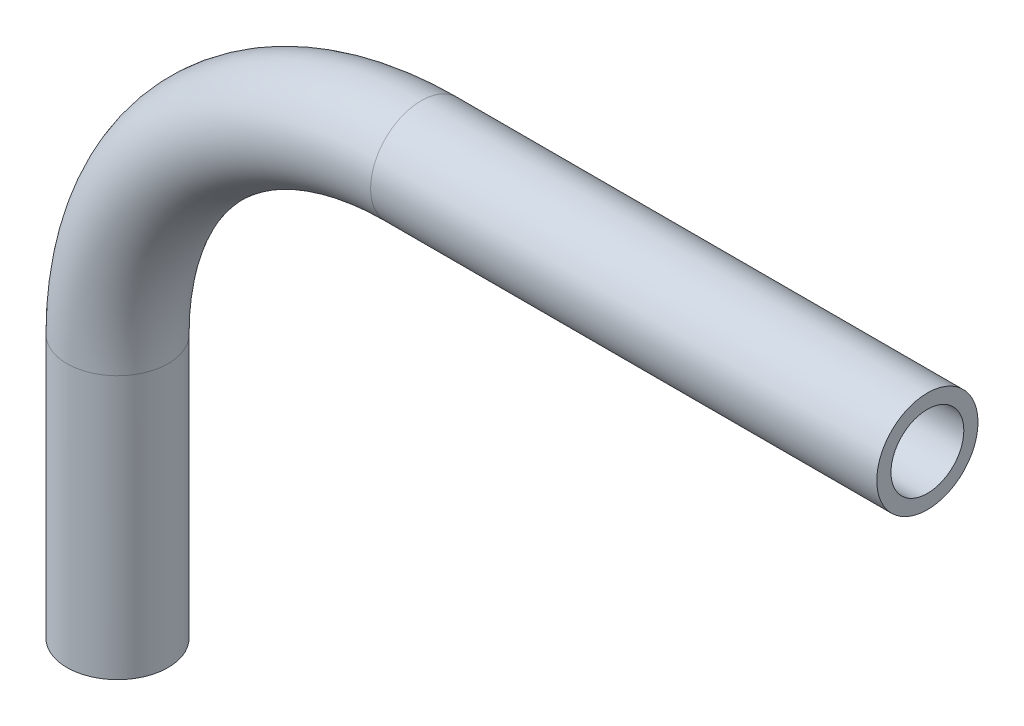
ISO-10303-21;
HEADER;
FILE_DESCRIPTION(('STEP AP214'),'2;1');
FILE_NAME('part.step','',(''),(''),'','','');
FILE_SCHEMA(('AUTOMOTIVE_DESIGN { 1 0 10303 214 1 1 1 1 }'));
ENDSEC;
DATA;
#1=APPLICATION_CONTEXT('core data for automotive mechanical design processes');
#2=APPLICATION_PROTOCOL_DEFINITION('international standard','automotive_design',2000,#1);
#3=PRODUCT_CONTEXT('',#1,'mechanical');
#4=PRODUCT('Part','Part','',(#3));
#5=PRODUCT_RELATED_PRODUCT_CATEGORY('part','',(#4));
#6=PRODUCT_DEFINITION_FORMATION('','',#4);
#7=PRODUCT_DEFINITION_CONTEXT('part definition',#1,'design');
#8=PRODUCT_DEFINITION('design','',#6,#7);
#9=PRODUCT_DEFINITION_SHAPE('','',#8);
#10=(LENGTH_UNIT() NAMED_UNIT(*) SI_UNIT(.MILLI.,.METRE.));
#11=(NAMED_UNIT(*) PLANE_ANGLE_UNIT() SI_UNIT($,.RADIAN.));
#12=(NAMED_UNIT(*) SI_UNIT($,.STERADIAN.) SOLID_ANGLE_UNIT());
#13=UNCERTAINTY_MEASURE_WITH_UNIT(LENGTH_MEASURE(1.E-05),#10,'distance_accuracy_value','');
#14=(GEOMETRIC_REPRESENTATION_CONTEXT(3) GLOBAL_UNCERTAINTY_ASSIGNED_CONTEXT((#13)) GLOBAL_UNIT_ASSIGNED_CONTEXT((#10,
#11,#12)) REPRESENTATION_CONTEXT('',''));
#15=CARTESIAN_POINT('',(0.,0.,0.));
#16=DIRECTION('',(0.,0.,1.));
#17=DIRECTION('',(1.,0.,0.));
#18=AXIS2_PLACEMENT_3D('',#15,#16,#17);
#19=CARTESIAN_POINT('',(0.,-18.0323178807947,0.));
#20=DIRECTION('',(0.,1.,0.));
#21=DIRECTION('',(0.,0.,1.));
#22=AXIS2_PLACEMENT_3D('',#19,#20,#21);
#23=CYLINDRICAL_SURFACE('',#22,3.175);
#24=CARTESIAN_POINT('',(0.,-1.52231788079484,0.));
#25=DIRECTION('',(0.,1.,0.));
#26=DIRECTION('',(0.,0.,-1.));
#27=AXIS2_PLACEMENT_3D('',#24,#25,#26);
#28=CIRCLE('',#27,3.175);
#29=CARTESIAN_POINT('',(-3.175,-1.52231788079487,0.));
#30=VERTEX_POINT('',#29);
#31=EDGE_CURVE('E90',#30,#30,#28,.T.);
#32=ORIENTED_EDGE('',*,*,#31,.F.);
#33=EDGE_LOOP('',(#32));
#34=FACE_BOUND('',#33,.T.);
#35=CARTESIAN_POINT('',(0.,-18.0323178807947,0.));
#36=DIRECTION('',(0.,1.,0.));
#37=DIRECTION('',(0.,0.,-1.));
#38=AXIS2_PLACEMENT_3D('',#35,#36,#37);
#39=CIRCLE('',#38,3.175);
#40=CARTESIAN_POINT('',(0.,-18.0323178807947,-3.175));
#41=VERTEX_POINT('',#40);
#42=EDGE_CURVE('E55',#41,#41,#39,.T.);
#43=ORIENTED_EDGE('',*,*,#42,.T.);
#44=EDGE_LOOP('',(#43));
#45=FACE_BOUND('',#44,.T.);
#46=ADVANCED_FACE('F39',(#34,#45),#23,.T.);
#47=CARTESIAN_POINT('',(19.05,-1.52231788079469,0.));
#48=DIRECTION('',(0.,0.,-1.));
#49=DIRECTION('',(-1.,0.,0.));
#50=AXIS2_PLACEMENT_3D('',#47,#48,#49);
#51=TOROIDAL_SURFACE('',#50,19.05,3.175);
#52=CARTESIAN_POINT('',(19.05,17.5276821192057,0.));
#53=DIRECTION('',(1.,0.,0.));
#54=DIRECTION('',(0.,0.,-1.));
#55=AXIS2_PLACEMENT_3D('',#52,#53,#54);
#56=CIRCLE('',#55,3.175);
#57=CARTESIAN_POINT('',(19.05,20.7026821192053,0.));
#58=VERTEX_POINT('',#57);
#59=EDGE_CURVE('E43',#58,#58,#56,.T.);
#60=CARTESIAN_POINT('',(19.05,-1.52231788079469,0.));
#61=DIRECTION('',(0.,0.,-1.));
#62=DIRECTION('',(-1.,0.,0.));
#63=AXIS2_PLACEMENT_3D('',#60,#61,#62);
#64=CIRCLE('',#63,22.225);
#65=EDGE_CURVE('',#30,#58,#64,.T.);
#66=ORIENTED_EDGE('',*,*,#31,.T.);
#67=ORIENTED_EDGE('',*,*,#59,.F.);
#68=ORIENTED_EDGE('',*,*,#65,.T.);
#69=ORIENTED_EDGE('',*,*,#65,.F.);
#70=EDGE_LOOP('',(#66,#68,#67,#69));
#71=FACE_BOUND('',#70,.T.);
#72=ADVANCED_FACE('F100',(#71),#51,.T.);
#73=CARTESIAN_POINT('',(19.0500000000001,17.5276821192053,0.));
#74=DIRECTION('',(1.,0.,0.));
#75=DIRECTION('',(0.,1.,0.));
#76=AXIS2_PLACEMENT_3D('',#73,#74,#75);
#77=CYLINDRICAL_SURFACE('',#76,3.175);
#78=CARTESIAN_POINT('',(50.8,17.5276821192053,0.));
#79=DIRECTION('',(1.,0.,0.));
#80=DIRECTION('',(0.,0.,-1.));
#81=AXIS2_PLACEMENT_3D('',#78,#79,#80);
#82=CIRCLE('',#81,3.175);
#83=CARTESIAN_POINT('',(50.8,17.5276821192053,-3.175));
#84=VERTEX_POINT('',#83);
#85=EDGE_CURVE('E60',#84,#84,#82,.T.);
#86=ORIENTED_EDGE('',*,*,#85,.F.);
#87=EDGE_LOOP('',(#86));
#88=FACE_BOUND('',#87,.T.);
#89=ORIENTED_EDGE('',*,*,#59,.T.);
#90=EDGE_LOOP('',(#89));
#91=FACE_BOUND('',#90,.T.);
#92=ADVANCED_FACE('F41',(#88,#91),#77,.T.);
#93=CARTESIAN_POINT('',(0.,-18.0323178807947,0.));
#94=DIRECTION('',(0.,1.,0.));
#95=DIRECTION('',(0.,0.,-1.));
#96=AXIS2_PLACEMENT_3D('',#93,#94,#95);
#97=PLANE('',#96);
#98=CARTESIAN_POINT('',(0.,-18.0323178807947,0.));
#99=DIRECTION('',(0.,1.,0.));
#100=DIRECTION('',(0.,0.,-1.));
#101=AXIS2_PLACEMENT_3D('',#98,#99,#100);
#102=CIRCLE('',#101,2.286);
#103=CARTESIAN_POINT('',(0.,-18.0323178807947,-2.286));
#104=VERTEX_POINT('',#103);
#105=EDGE_CURVE('E83',#104,#104,#102,.F.);
#106=ORIENTED_EDGE('',*,*,#105,.F.);
#107=EDGE_LOOP('',(#106));
#108=FACE_BOUND('',#107,.T.);
#109=ORIENTED_EDGE('',*,*,#42,.F.);
#110=EDGE_LOOP('',(#109));
#111=FACE_BOUND('',#110,.T.);
#112=ADVANCED_FACE('F106',(#108,#111),#97,.F.);
#113=CARTESIAN_POINT('',(50.8,17.5276821192053,0.));
#114=DIRECTION('',(1.,0.,0.));
#115=DIRECTION('',(0.,0.,-1.));
#116=AXIS2_PLACEMENT_3D('',#113,#114,#115);
#117=PLANE('',#116);
#118=CARTESIAN_POINT('',(50.8,17.5276821192053,0.));
#119=DIRECTION('',(1.,0.,0.));
#120=DIRECTION('',(0.,0.,-1.));
#121=AXIS2_PLACEMENT_3D('',#118,#119,#120);
#122=CIRCLE('',#121,2.286);
#123=CARTESIAN_POINT('',(50.8,17.5276821192053,-2.286));
#124=VERTEX_POINT('',#123);
#125=EDGE_CURVE('E11',#124,#124,#122,.F.);
#126=ORIENTED_EDGE('',*,*,#125,.T.);
#127=EDGE_LOOP('',(#126));
#128=FACE_BOUND('',#127,.T.);
#129=ORIENTED_EDGE('',*,*,#85,.T.);
#130=EDGE_LOOP('',(#129));
#131=FACE_BOUND('',#130,.T.);
#132=ADVANCED_FACE('F67',(#128,#131),#117,.T.);
#133=CARTESIAN_POINT('',(0.,-18.0323178807947,0.));
#134=DIRECTION('',(0.,1.,0.));
#135=DIRECTION('',(0.,0.,1.));
#136=AXIS2_PLACEMENT_3D('',#133,#134,#135);
#137=CYLINDRICAL_SURFACE('',#136,2.286);
#138=CARTESIAN_POINT('',(0.,-1.52231788079484,0.));
#139=DIRECTION('',(0.,1.,0.));
#140=DIRECTION('',(0.,0.,-1.));
#141=AXIS2_PLACEMENT_3D('',#138,#139,#140);
#142=CIRCLE('',#141,2.286);
#143=CARTESIAN_POINT('',(-2.286,-1.52231788079486,0.));
#144=VERTEX_POINT('',#143);
#145=EDGE_CURVE('E79',#144,#144,#142,.F.);
#146=ORIENTED_EDGE('',*,*,#145,.F.);
#147=EDGE_LOOP('',(#146));
#148=FACE_BOUND('',#147,.T.);
#149=ORIENTED_EDGE('',*,*,#105,.T.);
#150=EDGE_LOOP('',(#149));
#151=FACE_BOUND('',#150,.T.);
#152=ADVANCED_FACE('F114',(#148,#151),#137,.F.);
#153=CARTESIAN_POINT('',(19.05,-1.52231788079469,0.));
#154=DIRECTION('',(0.,0.,-1.));
#155=DIRECTION('',(-1.,0.,0.));
#156=AXIS2_PLACEMENT_3D('',#153,#154,#155);
#157=TOROIDAL_SURFACE('',#156,19.05,2.286);
#158=CARTESIAN_POINT('',(19.05,17.5276821192057,0.));
#159=DIRECTION('',(1.,0.,0.));
#160=DIRECTION('',(0.,0.,-1.));
#161=AXIS2_PLACEMENT_3D('',#158,#159,#160);
#162=CIRCLE('',#161,2.286);
#163=CARTESIAN_POINT('',(19.05,19.8136821192053,0.));
#164=VERTEX_POINT('',#163);
#165=EDGE_CURVE('E49',#164,#164,#162,.F.);
#166=CARTESIAN_POINT('',(19.05,-1.52231788079469,0.));
#167=DIRECTION('',(0.,0.,-1.));
#168=DIRECTION('',(-1.,0.,0.));
#169=AXIS2_PLACEMENT_3D('',#166,#167,#168);
#170=CIRCLE('',#169,21.336);
#171=EDGE_CURVE('',#144,#164,#170,.T.);
#172=ORIENTED_EDGE('',*,*,#145,.T.);
#173=ORIENTED_EDGE('',*,*,#165,.F.);
#174=ORIENTED_EDGE('',*,*,#171,.T.);
#175=ORIENTED_EDGE('',*,*,#171,.F.);
#176=EDGE_LOOP('',(#172,#174,#173,#175));
#177=FACE_BOUND('',#176,.T.);
#178=ADVANCED_FACE('F73',(#177),#157,.F.);
#179=CARTESIAN_POINT('',(19.0500000000001,17.5276821192053,0.));
#180=DIRECTION('',(1.,0.,0.));
#181=DIRECTION('',(0.,1.,0.));
#182=AXIS2_PLACEMENT_3D('',#179,#180,#181);
#183=CYLINDRICAL_SURFACE('',#182,2.286);
#184=ORIENTED_EDGE('',*,*,#125,.F.);
#185=EDGE_LOOP('',(#184));
#186=FACE_BOUND('',#185,.T.);
#187=ORIENTED_EDGE('',*,*,#165,.T.);
#188=EDGE_LOOP('',(#187));
#189=FACE_BOUND('',#188,.T.);
#190=ADVANCED_FACE('F70',(#186,#189),#183,.F.);
#191=CLOSED_SHELL('',(#46,#72,#92,#112,#132,#152,#178,#190));
#192=MANIFOLD_SOLID_BREP('B2',#191);
#193=ADVANCED_BREP_SHAPE_REPRESENTATION('',(#18,#192),#14);
#194=SHAPE_DEFINITION_REPRESENTATION(#9,#193);
ENDSEC;
END-ISO-10303-21;
